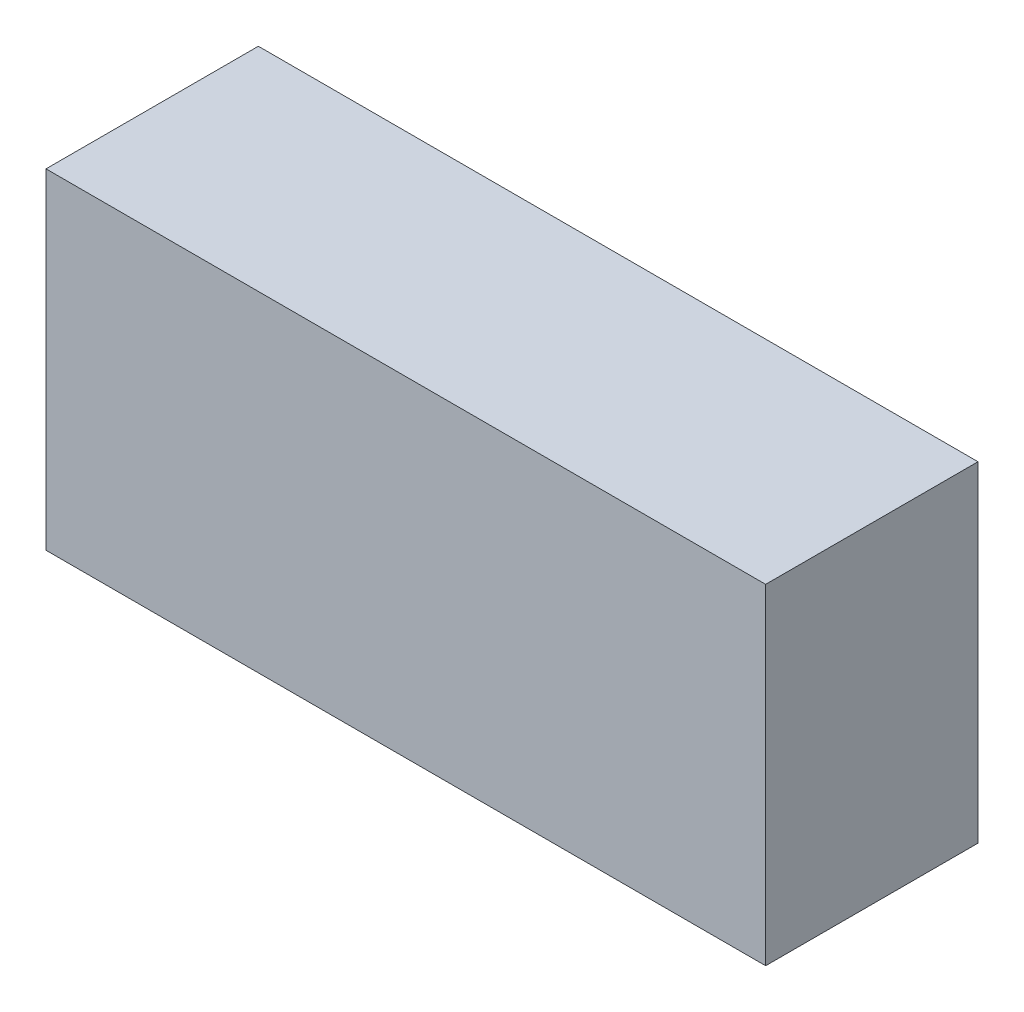
ISO-10303-21;
HEADER;
FILE_DESCRIPTION(('STEP AP214'),'2;1');
FILE_NAME('part.step','',(''),(''),'','','');
FILE_SCHEMA(('AUTOMOTIVE_DESIGN { 1 0 10303 214 1 1 1 1 }'));
ENDSEC;
DATA;
#1=APPLICATION_CONTEXT('core data for automotive mechanical design processes');
#2=APPLICATION_PROTOCOL_DEFINITION('international standard','automotive_design',2000,#1);
#3=PRODUCT_CONTEXT('',#1,'mechanical');
#4=PRODUCT('Part','Part','',(#3));
#5=PRODUCT_RELATED_PRODUCT_CATEGORY('part','',(#4));
#6=PRODUCT_DEFINITION_FORMATION('','',#4);
#7=PRODUCT_DEFINITION_CONTEXT('part definition',#1,'design');
#8=PRODUCT_DEFINITION('design','',#6,#7);
#9=PRODUCT_DEFINITION_SHAPE('','',#8);
#10=(LENGTH_UNIT() NAMED_UNIT(*) SI_UNIT(.MILLI.,.METRE.));
#11=(NAMED_UNIT(*) PLANE_ANGLE_UNIT() SI_UNIT($,.RADIAN.));
#12=(NAMED_UNIT(*) SI_UNIT($,.STERADIAN.) SOLID_ANGLE_UNIT());
#13=UNCERTAINTY_MEASURE_WITH_UNIT(LENGTH_MEASURE(1.E-05),#10,'distance_accuracy_value','');
#14=(GEOMETRIC_REPRESENTATION_CONTEXT(3) GLOBAL_UNCERTAINTY_ASSIGNED_CONTEXT((#13)) GLOBAL_UNIT_ASSIGNED_CONTEXT((#10,
#11,#12)) REPRESENTATION_CONTEXT('',''));
#15=CARTESIAN_POINT('',(0.,0.,0.));
#16=DIRECTION('',(0.,0.,1.));
#17=DIRECTION('',(1.,0.,0.));
#18=AXIS2_PLACEMENT_3D('',#15,#16,#17);
#19=CARTESIAN_POINT('',(0.7747,-0.3556,0.4572));
#20=DIRECTION('',(0.,0.,1.));
#21=DIRECTION('',(1.,0.,0.));
#22=AXIS2_PLACEMENT_3D('',#19,#20,#21);
#23=PLANE('',#22);
#24=DIRECTION('',(0.,1.,0.));
#25=VECTOR('',#24,1.);
#26=CARTESIAN_POINT('',(-0.7747,-0.3556,0.4572));
#27=LINE('',#26,#25);
#28=CARTESIAN_POINT('',(-0.7747,-0.3556,0.4572));
#29=VERTEX_POINT('',#28);
#30=CARTESIAN_POINT('',(-0.7747,0.3556,0.4572));
#31=VERTEX_POINT('',#30);
#32=EDGE_CURVE('E53',#29,#31,#27,.T.);
#33=ORIENTED_EDGE('',*,*,#32,.F.);
#34=DIRECTION('',(1.,0.,0.));
#35=VECTOR('',#34,1.);
#36=CARTESIAN_POINT('',(0.7747,-0.3556,0.4572));
#37=LINE('',#36,#35);
#38=CARTESIAN_POINT('',(0.7747,-0.3556,0.4572));
#39=VERTEX_POINT('',#38);
#40=EDGE_CURVE('E68',#39,#29,#37,.F.);
#41=ORIENTED_EDGE('',*,*,#40,.F.);
#42=DIRECTION('',(0.,1.,0.));
#43=VECTOR('',#42,1.);
#44=CARTESIAN_POINT('',(0.7747,0.3556,0.4572));
#45=LINE('',#44,#43);
#46=CARTESIAN_POINT('',(0.7747,0.3556,0.4572));
#47=VERTEX_POINT('',#46);
#48=EDGE_CURVE('E20',#47,#39,#45,.F.);
#49=ORIENTED_EDGE('',*,*,#48,.F.);
#50=DIRECTION('',(1.,0.,0.));
#51=VECTOR('',#50,1.);
#52=CARTESIAN_POINT('',(-0.7747,0.3556,0.4572));
#53=LINE('',#52,#51);
#54=EDGE_CURVE('E58',#31,#47,#53,.T.);
#55=ORIENTED_EDGE('',*,*,#54,.F.);
#56=EDGE_LOOP('',(#33,#41,#49,#55));
#57=FACE_BOUND('',#56,.T.);
#58=ADVANCED_FACE('F17',(#57),#23,.T.);
#59=CARTESIAN_POINT('',(0.7747,0.3556,0.));
#60=DIRECTION('',(1.,0.,0.));
#61=DIRECTION('',(0.,0.,-1.));
#62=AXIS2_PLACEMENT_3D('',#59,#60,#61);
#63=PLANE('',#62);
#64=DIRECTION('',(0.,0.,-1.));
#65=VECTOR('',#64,1.);
#66=CARTESIAN_POINT('',(0.7747,-0.3556,0.));
#67=LINE('',#66,#65);
#68=CARTESIAN_POINT('',(0.7747,-0.3556,0.));
#69=VERTEX_POINT('',#68);
#70=EDGE_CURVE('E79',#69,#39,#67,.F.);
#71=ORIENTED_EDGE('',*,*,#70,.F.);
#72=DIRECTION('',(0.,1.,0.));
#73=VECTOR('',#72,1.);
#74=CARTESIAN_POINT('',(0.7747,-0.3556,0.));
#75=LINE('',#74,#73);
#76=CARTESIAN_POINT('',(0.7747,0.3556,0.));
#77=VERTEX_POINT('',#76);
#78=EDGE_CURVE('E74',#69,#77,#75,.T.);
#79=ORIENTED_EDGE('',*,*,#78,.T.);
#80=DIRECTION('',(0.,0.,1.));
#81=VECTOR('',#80,1.);
#82=CARTESIAN_POINT('',(0.7747,0.3556,0.));
#83=LINE('',#82,#81);
#84=EDGE_CURVE('E63',#47,#77,#83,.F.);
#85=ORIENTED_EDGE('',*,*,#84,.F.);
#86=ORIENTED_EDGE('',*,*,#48,.T.);
#87=EDGE_LOOP('',(#71,#79,#85,#86));
#88=FACE_BOUND('',#87,.T.);
#89=ADVANCED_FACE('F73',(#88),#63,.T.);
#90=CARTESIAN_POINT('',(-0.7747,0.3556,0.));
#91=DIRECTION('',(0.,1.,0.));
#92=DIRECTION('',(0.,0.,1.));
#93=AXIS2_PLACEMENT_3D('',#90,#91,#92);
#94=PLANE('',#93);
#95=ORIENTED_EDGE('',*,*,#84,.T.);
#96=DIRECTION('',(1.,0.,0.));
#97=VECTOR('',#96,1.);
#98=CARTESIAN_POINT('',(0.7747,0.3556,0.));
#99=LINE('',#98,#97);
#100=CARTESIAN_POINT('',(-0.7747,0.3556,0.));
#101=VERTEX_POINT('',#100);
#102=EDGE_CURVE('E84',#77,#101,#99,.F.);
#103=ORIENTED_EDGE('',*,*,#102,.T.);
#104=DIRECTION('',(0.,0.,1.));
#105=VECTOR('',#104,1.);
#106=CARTESIAN_POINT('',(-0.7747,0.3556,0.));
#107=LINE('',#106,#105);
#108=EDGE_CURVE('E65',#31,#101,#107,.F.);
#109=ORIENTED_EDGE('',*,*,#108,.F.);
#110=ORIENTED_EDGE('',*,*,#54,.T.);
#111=EDGE_LOOP('',(#95,#103,#109,#110));
#112=FACE_BOUND('',#111,.T.);
#113=ADVANCED_FACE('F60',(#112),#94,.T.);
#114=CARTESIAN_POINT('',(-0.7747,-0.3556,0.));
#115=DIRECTION('',(-1.,0.,0.));
#116=DIRECTION('',(0.,0.,1.));
#117=AXIS2_PLACEMENT_3D('',#114,#115,#116);
#118=PLANE('',#117);
#119=ORIENTED_EDGE('',*,*,#108,.T.);
#120=DIRECTION('',(0.,1.,0.));
#121=VECTOR('',#120,1.);
#122=CARTESIAN_POINT('',(-0.7747,-0.3556,0.));
#123=LINE('',#122,#121);
#124=CARTESIAN_POINT('',(-0.7747,-0.3556,0.));
#125=VERTEX_POINT('',#124);
#126=EDGE_CURVE('E26',#101,#125,#123,.F.);
#127=ORIENTED_EDGE('',*,*,#126,.T.);
#128=DIRECTION('',(0.,0.,-1.));
#129=VECTOR('',#128,1.);
#130=CARTESIAN_POINT('',(-0.7747,-0.3556,0.));
#131=LINE('',#130,#129);
#132=EDGE_CURVE('E34',#29,#125,#131,.T.);
#133=ORIENTED_EDGE('',*,*,#132,.F.);
#134=ORIENTED_EDGE('',*,*,#32,.T.);
#135=EDGE_LOOP('',(#119,#127,#133,#134));
#136=FACE_BOUND('',#135,.T.);
#137=ADVANCED_FACE('F88',(#136),#118,.T.);
#138=CARTESIAN_POINT('',(0.7747,-0.3556,0.));
#139=DIRECTION('',(0.,-1.,0.));
#140=DIRECTION('',(0.,0.,-1.));
#141=AXIS2_PLACEMENT_3D('',#138,#139,#140);
#142=PLANE('',#141);
#143=ORIENTED_EDGE('',*,*,#132,.T.);
#144=DIRECTION('',(1.,0.,0.));
#145=VECTOR('',#144,1.);
#146=CARTESIAN_POINT('',(0.7747,-0.3556,0.));
#147=LINE('',#146,#145);
#148=EDGE_CURVE('E11',#125,#69,#147,.T.);
#149=ORIENTED_EDGE('',*,*,#148,.T.);
#150=ORIENTED_EDGE('',*,*,#70,.T.);
#151=ORIENTED_EDGE('',*,*,#40,.T.);
#152=EDGE_LOOP('',(#143,#149,#150,#151));
#153=FACE_BOUND('',#152,.T.);
#154=ADVANCED_FACE('F91',(#153),#142,.T.);
#155=CARTESIAN_POINT('',(0.7747,-0.3556,0.));
#156=DIRECTION('',(0.,0.,1.));
#157=DIRECTION('',(1.,0.,0.));
#158=AXIS2_PLACEMENT_3D('',#155,#156,#157);
#159=PLANE('',#158);
#160=ORIENTED_EDGE('',*,*,#126,.F.);
#161=ORIENTED_EDGE('',*,*,#102,.F.);
#162=ORIENTED_EDGE('',*,*,#78,.F.);
#163=ORIENTED_EDGE('',*,*,#148,.F.);
#164=EDGE_LOOP('',(#160,#161,#162,#163));
#165=FACE_BOUND('',#164,.T.);
#166=ADVANCED_FACE('F90',(#165),#159,.F.);
#167=CLOSED_SHELL('',(#58,#89,#113,#137,#154,#166));
#168=MANIFOLD_SOLID_BREP('B1',#167);
#169=ADVANCED_BREP_SHAPE_REPRESENTATION('',(#18,#168),#14);
#170=SHAPE_DEFINITION_REPRESENTATION(#9,#169);
ENDSEC;
END-ISO-10303-21;
